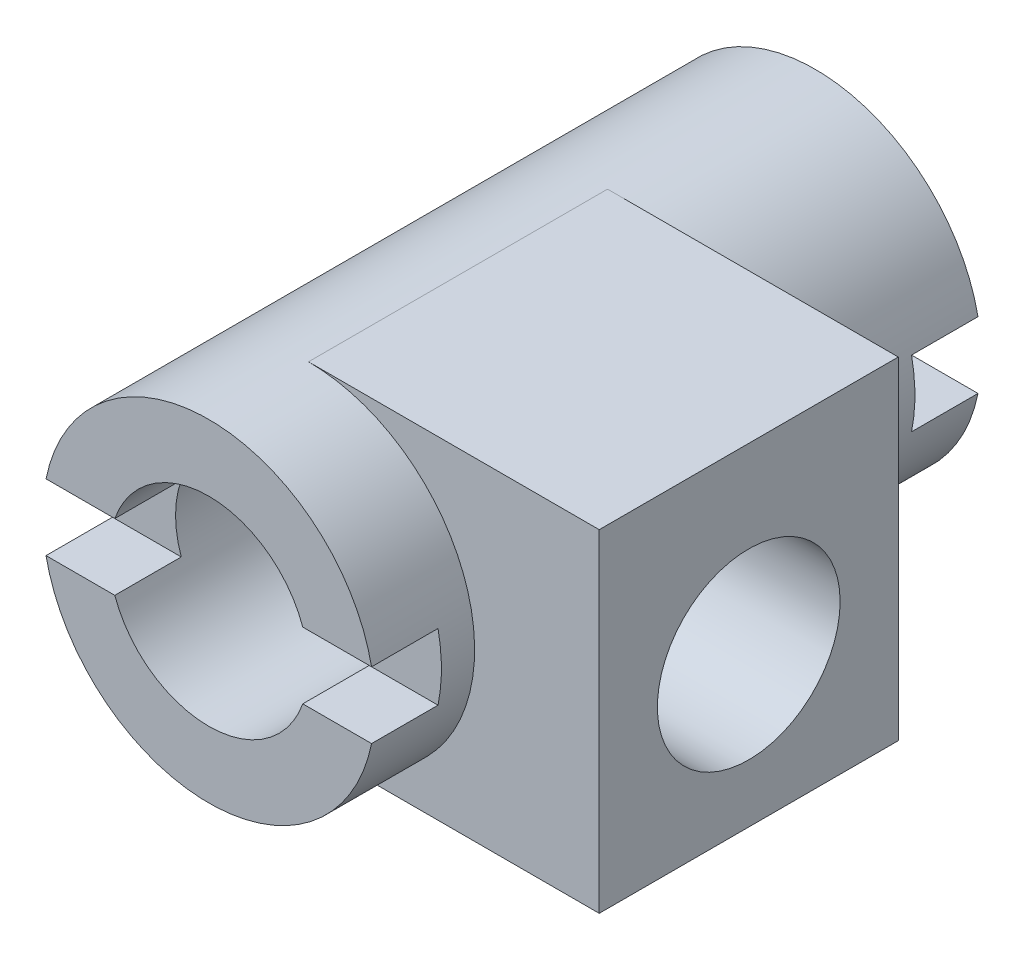
ISO-10303-21;
HEADER;
FILE_DESCRIPTION(('STEP AP214'),'2;1');
FILE_NAME('part.step','',(''),(''),'','','');
FILE_SCHEMA(('AUTOMOTIVE_DESIGN { 1 0 10303 214 1 1 1 1 }'));
ENDSEC;
DATA;
#1=APPLICATION_CONTEXT('core data for automotive mechanical design processes');
#2=APPLICATION_PROTOCOL_DEFINITION('international standard','automotive_design',2000,#1);
#3=PRODUCT_CONTEXT('',#1,'mechanical');
#4=PRODUCT('Part','Part','',(#3));
#5=PRODUCT_RELATED_PRODUCT_CATEGORY('part','',(#4));
#6=PRODUCT_DEFINITION_FORMATION('','',#4);
#7=PRODUCT_DEFINITION_CONTEXT('part definition',#1,'design');
#8=PRODUCT_DEFINITION('design','',#6,#7);
#9=PRODUCT_DEFINITION_SHAPE('','',#8);
#10=(LENGTH_UNIT() NAMED_UNIT(*) SI_UNIT(.MILLI.,.METRE.));
#11=(NAMED_UNIT(*) PLANE_ANGLE_UNIT() SI_UNIT($,.RADIAN.));
#12=(NAMED_UNIT(*) SI_UNIT($,.STERADIAN.) SOLID_ANGLE_UNIT());
#13=UNCERTAINTY_MEASURE_WITH_UNIT(LENGTH_MEASURE(1.E-05),#10,'distance_accuracy_value','');
#14=(GEOMETRIC_REPRESENTATION_CONTEXT(3) GLOBAL_UNCERTAINTY_ASSIGNED_CONTEXT((#13)) GLOBAL_UNIT_ASSIGNED_CONTEXT((#10,
#11,#12)) REPRESENTATION_CONTEXT('',''));
#15=CARTESIAN_POINT('',(0.,0.,0.));
#16=DIRECTION('',(0.,0.,1.));
#17=DIRECTION('',(1.,0.,0.));
#18=AXIS2_PLACEMENT_3D('',#15,#16,#17);
#19=CARTESIAN_POINT('',(0.,0.,-73.));
#20=DIRECTION('',(0.,0.,1.));
#21=DIRECTION('',(1.,0.,0.));
#22=AXIS2_PLACEMENT_3D('',#19,#20,#21);
#23=PLANE('',#22);
#24=CARTESIAN_POINT('',(0.,0.,-73.));
#25=DIRECTION('',(0.,0.,1.));
#26=DIRECTION('',(1.,0.,0.));
#27=AXIS2_PLACEMENT_3D('',#24,#25,#26);
#28=CIRCLE('',#27,20.);
#29=CARTESIAN_POINT('',(19.5959179422654,3.99999999999999,-73.));
#30=VERTEX_POINT('',#29);
#31=CARTESIAN_POINT('',(-19.5959179422654,4.,-73.));
#32=VERTEX_POINT('',#31);
#33=EDGE_CURVE('E195',#30,#32,#28,.T.);
#34=ORIENTED_EDGE('',*,*,#33,.F.);
#35=DIRECTION('',(1.,0.,0.));
#36=VECTOR('',#35,1.);
#37=CARTESIAN_POINT('',(21.2930166191036,3.99999999999999,-73.));
#38=LINE('',#37,#36);
#39=CARTESIAN_POINT('',(11.3137084989848,4.,-73.));
#40=VERTEX_POINT('',#39);
#41=EDGE_CURVE('E188',#40,#30,#38,.T.);
#42=ORIENTED_EDGE('',*,*,#41,.F.);
#43=CARTESIAN_POINT('',(0.,0.,-73.));
#44=DIRECTION('',(0.,0.,1.));
#45=DIRECTION('',(1.,0.,0.));
#46=AXIS2_PLACEMENT_3D('',#43,#44,#45);
#47=CIRCLE('',#46,12.);
#48=CARTESIAN_POINT('',(-11.3137084989848,4.,-73.));
#49=VERTEX_POINT('',#48);
#50=EDGE_CURVE('E343',#40,#49,#47,.T.);
#51=ORIENTED_EDGE('',*,*,#50,.T.);
#52=EDGE_CURVE('E242',#32,#49,#38,.T.);
#53=ORIENTED_EDGE('',*,*,#52,.F.);
#54=EDGE_LOOP('',(#34,#42,#51,#53));
#55=FACE_BOUND('',#54,.T.);
#56=ADVANCED_FACE('F33',(#55),#23,.F.);
#57=CARTESIAN_POINT('',(0.,0.,0.));
#58=DIRECTION('',(0.,0.,1.));
#59=DIRECTION('',(1.,0.,0.));
#60=AXIS2_PLACEMENT_3D('',#57,#58,#59);
#61=PLANE('',#60);
#62=DIRECTION('',(-1.,0.,0.));
#63=VECTOR('',#62,1.);
#64=CARTESIAN_POINT('',(-25.8708933431482,4.,0.));
#65=LINE('',#64,#63);
#66=CARTESIAN_POINT('',(19.5959179422654,4.,0.));
#67=VERTEX_POINT('',#66);
#68=CARTESIAN_POINT('',(11.3137084989848,4.,0.));
#69=VERTEX_POINT('',#68);
#70=EDGE_CURVE('E261',#67,#69,#65,.T.);
#71=ORIENTED_EDGE('',*,*,#70,.F.);
#72=CARTESIAN_POINT('',(0.,0.,0.));
#73=DIRECTION('',(0.,0.,1.));
#74=DIRECTION('',(1.,0.,0.));
#75=AXIS2_PLACEMENT_3D('',#72,#73,#74);
#76=CIRCLE('',#75,20.);
#77=CARTESIAN_POINT('',(-19.5959179422654,4.,0.));
#78=VERTEX_POINT('',#77);
#79=EDGE_CURVE('E196',#67,#78,#76,.T.);
#80=ORIENTED_EDGE('',*,*,#79,.T.);
#81=CARTESIAN_POINT('',(-11.3137084989848,4.,0.));
#82=VERTEX_POINT('',#81);
#83=EDGE_CURVE('E268',#82,#78,#65,.T.);
#84=ORIENTED_EDGE('',*,*,#83,.F.);
#85=CARTESIAN_POINT('',(0.,0.,0.));
#86=DIRECTION('',(0.,0.,1.));
#87=DIRECTION('',(1.,0.,0.));
#88=AXIS2_PLACEMENT_3D('',#85,#86,#87);
#89=CIRCLE('',#88,12.);
#90=EDGE_CURVE('E204',#69,#82,#89,.T.);
#91=ORIENTED_EDGE('',*,*,#90,.F.);
#92=EDGE_LOOP('',(#71,#80,#84,#91));
#93=FACE_BOUND('',#92,.T.);
#94=ADVANCED_FACE('F325',(#93),#61,.T.);
#95=CARTESIAN_POINT('',(0.,0.,-73.));
#96=DIRECTION('',(0.,0.,1.));
#97=DIRECTION('',(1.,0.,0.));
#98=AXIS2_PLACEMENT_3D('',#95,#96,#97);
#99=CYLINDRICAL_SURFACE('',#98,20.);
#100=DIRECTION('',(0.,0.,1.));
#101=VECTOR('',#100,1.);
#102=CARTESIAN_POINT('',(-19.5959179422654,4.,-73.));
#103=LINE('',#102,#101);
#104=CARTESIAN_POINT('',(-19.5959179422654,4.,-65.));
#105=VERTEX_POINT('',#104);
#106=EDGE_CURVE('E254',#105,#32,#103,.F.);
#107=ORIENTED_EDGE('',*,*,#106,.F.);
#108=CARTESIAN_POINT('',(0.,0.,-65.));
#109=DIRECTION('',(0.,0.,1.));
#110=DIRECTION('',(1.,0.,0.));
#111=AXIS2_PLACEMENT_3D('',#108,#109,#110);
#112=CIRCLE('',#111,20.);
#113=CARTESIAN_POINT('',(-19.5959179422654,-4.,-65.));
#114=VERTEX_POINT('',#113);
#115=EDGE_CURVE('E251',#114,#105,#112,.F.);
#116=ORIENTED_EDGE('',*,*,#115,.F.);
#117=DIRECTION('',(0.,0.,1.));
#118=VECTOR('',#117,1.);
#119=CARTESIAN_POINT('',(-19.5959179422654,-4.,-73.));
#120=LINE('',#119,#118);
#121=CARTESIAN_POINT('',(-19.5959179422654,-4.,-73.));
#122=VERTEX_POINT('',#121);
#123=EDGE_CURVE('E178',#122,#114,#120,.T.);
#124=ORIENTED_EDGE('',*,*,#123,.F.);
#125=CARTESIAN_POINT('',(19.5959179422654,-4.00000000000001,-73.));
#126=VERTEX_POINT('',#125);
#127=EDGE_CURVE('E185',#122,#126,#28,.T.);
#128=ORIENTED_EDGE('',*,*,#127,.T.);
#129=DIRECTION('',(0.,0.,1.));
#130=VECTOR('',#129,1.);
#131=CARTESIAN_POINT('',(19.5959179422654,-4.00000000000001,-73.));
#132=LINE('',#131,#130);
#133=CARTESIAN_POINT('',(19.5959179422654,-4.00000000000001,-65.));
#134=VERTEX_POINT('',#133);
#135=EDGE_CURVE('E169',#134,#126,#132,.F.);
#136=ORIENTED_EDGE('',*,*,#135,.F.);
#137=CARTESIAN_POINT('',(19.5959179422654,3.99999999999999,-65.));
#138=VERTEX_POINT('',#137);
#139=EDGE_CURVE('E249',#138,#134,#112,.F.);
#140=ORIENTED_EDGE('',*,*,#139,.F.);
#141=DIRECTION('',(0.,0.,1.));
#142=VECTOR('',#141,1.);
#143=CARTESIAN_POINT('',(19.5959179422654,3.99999999999999,-73.));
#144=LINE('',#143,#142);
#145=EDGE_CURVE('E177',#30,#138,#144,.T.);
#146=ORIENTED_EDGE('',*,*,#145,.F.);
#147=ORIENTED_EDGE('',*,*,#33,.T.);
#148=EDGE_LOOP('',(#107,#116,#124,#128,#136,#140,#146,#147));
#149=FACE_BOUND('',#148,.T.);
#150=DIRECTION('',(0.,0.,1.));
#151=VECTOR('',#150,1.);
#152=CARTESIAN_POINT('',(-19.5959179422654,4.,-73.));
#153=LINE('',#152,#151);
#154=CARTESIAN_POINT('',(-19.5959179422654,4.,-7.99999999999999));
#155=VERTEX_POINT('',#154);
#156=EDGE_CURVE('E280',#78,#155,#153,.F.);
#157=ORIENTED_EDGE('',*,*,#156,.F.);
#158=ORIENTED_EDGE('',*,*,#79,.F.);
#159=DIRECTION('',(0.,0.,1.));
#160=VECTOR('',#159,1.);
#161=CARTESIAN_POINT('',(19.5959179422654,4.,-73.));
#162=LINE('',#161,#160);
#163=CARTESIAN_POINT('',(19.5959179422654,4.,-7.99999999999999));
#164=VERTEX_POINT('',#163);
#165=EDGE_CURVE('E278',#164,#67,#162,.T.);
#166=ORIENTED_EDGE('',*,*,#165,.F.);
#167=CARTESIAN_POINT('',(0.,0.,-7.99999999999999));
#168=DIRECTION('',(0.,0.,1.));
#169=DIRECTION('',(1.,0.,0.));
#170=AXIS2_PLACEMENT_3D('',#167,#168,#169);
#171=CIRCLE('',#170,20.);
#172=CARTESIAN_POINT('',(19.5959179422654,-4.,-7.99999999999999));
#173=VERTEX_POINT('',#172);
#174=EDGE_CURVE('E270',#164,#173,#171,.F.);
#175=ORIENTED_EDGE('',*,*,#174,.T.);
#176=DIRECTION('',(0.,0.,1.));
#177=VECTOR('',#176,1.);
#178=CARTESIAN_POINT('',(19.5959179422654,-4.,-73.));
#179=LINE('',#178,#177);
#180=CARTESIAN_POINT('',(19.5959179422654,-4.,0.));
#181=VERTEX_POINT('',#180);
#182=EDGE_CURVE('E276',#181,#173,#179,.F.);
#183=ORIENTED_EDGE('',*,*,#182,.F.);
#184=CARTESIAN_POINT('',(-19.5959179422654,-4.,0.));
#185=VERTEX_POINT('',#184);
#186=EDGE_CURVE('E201',#185,#181,#76,.T.);
#187=ORIENTED_EDGE('',*,*,#186,.F.);
#188=DIRECTION('',(0.,0.,1.));
#189=VECTOR('',#188,1.);
#190=CARTESIAN_POINT('',(-19.5959179422654,-4.,-73.));
#191=LINE('',#190,#189);
#192=CARTESIAN_POINT('',(-19.5959179422654,-4.,-7.99999999999999));
#193=VERTEX_POINT('',#192);
#194=EDGE_CURVE('E274',#193,#185,#191,.T.);
#195=ORIENTED_EDGE('',*,*,#194,.F.);
#196=EDGE_CURVE('E273',#193,#155,#171,.F.);
#197=ORIENTED_EDGE('',*,*,#196,.T.);
#198=EDGE_LOOP('',(#157,#158,#166,#175,#183,#187,#195,#197));
#199=FACE_BOUND('',#198,.T.);
#200=CARTESIAN_POINT('',(0.,0.,-12.));
#201=DIRECTION('',(0.,0.,1.));
#202=DIRECTION('',(0.,-1.,0.));
#203=AXIS2_PLACEMENT_3D('',#200,#201,#202);
#204=CIRCLE('',#203,20.);
#205=CARTESIAN_POINT('',(0.,-20.,-12.));
#206=VERTEX_POINT('',#205);
#207=CARTESIAN_POINT('',(0.,20.,-12.));
#208=VERTEX_POINT('',#207);
#209=EDGE_CURVE('E355',#206,#208,#204,.T.);
#210=ORIENTED_EDGE('',*,*,#209,.T.);
#211=DIRECTION('',(0.,0.,1.));
#212=VECTOR('',#211,1.);
#213=CARTESIAN_POINT('',(0.,20.,-73.));
#214=LINE('',#213,#212);
#215=CARTESIAN_POINT('',(0.,20.,-48.));
#216=VERTEX_POINT('',#215);
#217=EDGE_CURVE('E282',#216,#208,#214,.T.);
#218=ORIENTED_EDGE('',*,*,#217,.F.);
#219=CARTESIAN_POINT('',(0.,0.,-48.));
#220=DIRECTION('',(0.,0.,-1.));
#221=DIRECTION('',(-1.,0.,0.));
#222=AXIS2_PLACEMENT_3D('',#219,#220,#221);
#223=CIRCLE('',#222,20.);
#224=CARTESIAN_POINT('',(0.,-20.,-48.));
#225=VERTEX_POINT('',#224);
#226=EDGE_CURVE('E356',#216,#225,#223,.T.);
#227=ORIENTED_EDGE('',*,*,#226,.T.);
#228=DIRECTION('',(0.,0.,1.));
#229=VECTOR('',#228,1.);
#230=CARTESIAN_POINT('',(0.,-20.,-73.));
#231=LINE('',#230,#229);
#232=EDGE_CURVE('E300',#225,#206,#231,.T.);
#233=ORIENTED_EDGE('',*,*,#232,.T.);
#234=EDGE_LOOP('',(#210,#218,#227,#233));
#235=FACE_BOUND('',#234,.T.);
#236=ADVANCED_FACE('F35',(#149,#199,#235),#99,.T.);
#237=ORIENTED_EDGE('',*,*,#127,.F.);
#238=DIRECTION('',(-1.,0.,0.));
#239=VECTOR('',#238,1.);
#240=CARTESIAN_POINT('',(21.2930166191036,-4.00000000000001,-73.));
#241=LINE('',#240,#239);
#242=CARTESIAN_POINT('',(-11.3137084989848,-4.,-73.));
#243=VERTEX_POINT('',#242);
#244=EDGE_CURVE('E189',#243,#122,#241,.T.);
#245=ORIENTED_EDGE('',*,*,#244,.F.);
#246=CARTESIAN_POINT('',(11.3137084989848,-4.,-73.));
#247=VERTEX_POINT('',#246);
#248=EDGE_CURVE('E187',#243,#247,#47,.T.);
#249=ORIENTED_EDGE('',*,*,#248,.T.);
#250=EDGE_CURVE('E172',#126,#247,#241,.T.);
#251=ORIENTED_EDGE('',*,*,#250,.F.);
#252=EDGE_LOOP('',(#237,#245,#249,#251));
#253=FACE_BOUND('',#252,.T.);
#254=ADVANCED_FACE('F183',(#253),#23,.F.);
#255=DIRECTION('',(1.,0.,0.));
#256=VECTOR('',#255,1.);
#257=CARTESIAN_POINT('',(-25.8708933431482,-4.,0.));
#258=LINE('',#257,#256);
#259=CARTESIAN_POINT('',(-11.3137084989848,-4.,0.));
#260=VERTEX_POINT('',#259);
#261=EDGE_CURVE('E267',#185,#260,#258,.T.);
#262=ORIENTED_EDGE('',*,*,#261,.F.);
#263=ORIENTED_EDGE('',*,*,#186,.T.);
#264=CARTESIAN_POINT('',(11.3137084989848,-4.,0.));
#265=VERTEX_POINT('',#264);
#266=EDGE_CURVE('E256',#265,#181,#258,.T.);
#267=ORIENTED_EDGE('',*,*,#266,.F.);
#268=EDGE_CURVE('E357',#260,#265,#89,.T.);
#269=ORIENTED_EDGE('',*,*,#268,.F.);
#270=EDGE_LOOP('',(#262,#263,#267,#269));
#271=FACE_BOUND('',#270,.T.);
#272=ADVANCED_FACE('F321',(#271),#61,.T.);
#273=CARTESIAN_POINT('',(0.,0.,-73.));
#274=DIRECTION('',(0.,0.,1.));
#275=DIRECTION('',(1.,0.,0.));
#276=AXIS2_PLACEMENT_3D('',#273,#274,#275);
#277=CYLINDRICAL_SURFACE('',#276,12.);
#278=CARTESIAN_POINT('',(0.,0.,-65.));
#279=DIRECTION('',(0.,0.,1.));
#280=DIRECTION('',(1.,0.,0.));
#281=AXIS2_PLACEMENT_3D('',#278,#279,#280);
#282=CIRCLE('',#281,12.);
#283=CARTESIAN_POINT('',(-11.3137084989848,-4.,-65.));
#284=VERTEX_POINT('',#283);
#285=CARTESIAN_POINT('',(-11.3137084989848,4.,-65.));
#286=VERTEX_POINT('',#285);
#287=EDGE_CURVE('E225',#284,#286,#282,.F.);
#288=ORIENTED_EDGE('',*,*,#287,.T.);
#289=DIRECTION('',(0.,0.,1.));
#290=VECTOR('',#289,1.);
#291=CARTESIAN_POINT('',(-11.3137084989848,4.,-73.));
#292=LINE('',#291,#290);
#293=EDGE_CURVE('E11',#286,#49,#292,.F.);
#294=ORIENTED_EDGE('',*,*,#293,.T.);
#295=ORIENTED_EDGE('',*,*,#50,.F.);
#296=DIRECTION('',(0.,0.,1.));
#297=VECTOR('',#296,1.);
#298=CARTESIAN_POINT('',(11.3137084989848,4.,-73.));
#299=LINE('',#298,#297);
#300=CARTESIAN_POINT('',(11.3137084989848,4.,-65.));
#301=VERTEX_POINT('',#300);
#302=EDGE_CURVE('E227',#40,#301,#299,.T.);
#303=ORIENTED_EDGE('',*,*,#302,.T.);
#304=CARTESIAN_POINT('',(11.3137084989848,-4.,-65.));
#305=VERTEX_POINT('',#304);
#306=EDGE_CURVE('E221',#301,#305,#282,.F.);
#307=ORIENTED_EDGE('',*,*,#306,.T.);
#308=DIRECTION('',(0.,0.,1.));
#309=VECTOR('',#308,1.);
#310=CARTESIAN_POINT('',(11.3137084989848,-4.,-73.));
#311=LINE('',#310,#309);
#312=EDGE_CURVE('E224',#305,#247,#311,.F.);
#313=ORIENTED_EDGE('',*,*,#312,.T.);
#314=ORIENTED_EDGE('',*,*,#248,.F.);
#315=DIRECTION('',(0.,0.,1.));
#316=VECTOR('',#315,1.);
#317=CARTESIAN_POINT('',(-11.3137084989848,-4.,-73.));
#318=LINE('',#317,#316);
#319=EDGE_CURVE('E41',#243,#284,#318,.T.);
#320=ORIENTED_EDGE('',*,*,#319,.T.);
#321=EDGE_LOOP('',(#288,#294,#295,#303,#307,#313,#314,#320));
#322=FACE_BOUND('',#321,.T.);
#323=ORIENTED_EDGE('',*,*,#90,.T.);
#324=DIRECTION('',(0.,0.,1.));
#325=VECTOR('',#324,1.);
#326=CARTESIAN_POINT('',(-11.3137084989848,4.,-73.));
#327=LINE('',#326,#325);
#328=CARTESIAN_POINT('',(-11.3137084989848,4.,-7.99999999999999));
#329=VERTEX_POINT('',#328);
#330=EDGE_CURVE('E218',#82,#329,#327,.F.);
#331=ORIENTED_EDGE('',*,*,#330,.T.);
#332=CARTESIAN_POINT('',(0.,0.,-7.99999999999999));
#333=DIRECTION('',(0.,0.,1.));
#334=DIRECTION('',(1.,0.,0.));
#335=AXIS2_PLACEMENT_3D('',#332,#333,#334);
#336=CIRCLE('',#335,12.);
#337=CARTESIAN_POINT('',(-11.3137084989848,-4.,-7.99999999999999));
#338=VERTEX_POINT('',#337);
#339=EDGE_CURVE('E209',#338,#329,#336,.F.);
#340=ORIENTED_EDGE('',*,*,#339,.F.);
#341=DIRECTION('',(0.,0.,1.));
#342=VECTOR('',#341,1.);
#343=CARTESIAN_POINT('',(-11.3137084989848,-4.,-73.));
#344=LINE('',#343,#342);
#345=EDGE_CURVE('E215',#338,#260,#344,.T.);
#346=ORIENTED_EDGE('',*,*,#345,.T.);
#347=ORIENTED_EDGE('',*,*,#268,.T.);
#348=DIRECTION('',(0.,0.,1.));
#349=VECTOR('',#348,1.);
#350=CARTESIAN_POINT('',(11.3137084989848,-4.,-73.));
#351=LINE('',#350,#349);
#352=CARTESIAN_POINT('',(11.3137084989848,-4.,-7.99999999999999));
#353=VERTEX_POINT('',#352);
#354=EDGE_CURVE('E208',#265,#353,#351,.F.);
#355=ORIENTED_EDGE('',*,*,#354,.T.);
#356=CARTESIAN_POINT('',(11.3137084989848,4.,-7.99999999999999));
#357=VERTEX_POINT('',#356);
#358=EDGE_CURVE('E199',#357,#353,#336,.F.);
#359=ORIENTED_EDGE('',*,*,#358,.F.);
#360=DIRECTION('',(0.,0.,1.));
#361=VECTOR('',#360,1.);
#362=CARTESIAN_POINT('',(11.3137084989848,4.,-73.));
#363=LINE('',#362,#361);
#364=EDGE_CURVE('E212',#357,#69,#363,.T.);
#365=ORIENTED_EDGE('',*,*,#364,.T.);
#366=EDGE_LOOP('',(#323,#331,#340,#346,#347,#355,#359,#365));
#367=FACE_BOUND('',#366,.T.);
#368=ADVANCED_FACE('F232',(#322,#367),#277,.F.);
#369=CARTESIAN_POINT('',(-20.001,20.,-12.));
#370=DIRECTION('',(0.,1.,0.));
#371=DIRECTION('',(0.,0.,1.));
#372=AXIS2_PLACEMENT_3D('',#369,#370,#371);
#373=PLANE('',#372);
#374=DIRECTION('',(1.,0.,0.));
#375=VECTOR('',#374,1.);
#376=CARTESIAN_POINT('',(-20.001,20.,-48.));
#377=LINE('',#376,#375);
#378=CARTESIAN_POINT('',(35.,20.,-48.));
#379=VERTEX_POINT('',#378);
#380=EDGE_CURVE('E296',#216,#379,#377,.T.);
#381=ORIENTED_EDGE('',*,*,#380,.F.);
#382=ORIENTED_EDGE('',*,*,#217,.T.);
#383=DIRECTION('',(1.,0.,0.));
#384=VECTOR('',#383,1.);
#385=CARTESIAN_POINT('',(-20.001,20.,-12.));
#386=LINE('',#385,#384);
#387=CARTESIAN_POINT('',(35.,20.,-12.));
#388=VERTEX_POINT('',#387);
#389=EDGE_CURVE('E348',#208,#388,#386,.T.);
#390=ORIENTED_EDGE('',*,*,#389,.T.);
#391=DIRECTION('',(0.,0.,1.));
#392=VECTOR('',#391,1.);
#393=CARTESIAN_POINT('',(35.,20.,-12.));
#394=LINE('',#393,#392);
#395=EDGE_CURVE('E290',#379,#388,#394,.T.);
#396=ORIENTED_EDGE('',*,*,#395,.F.);
#397=EDGE_LOOP('',(#381,#382,#390,#396));
#398=FACE_BOUND('',#397,.T.);
#399=ADVANCED_FACE('F320',(#398),#373,.T.);
#400=CARTESIAN_POINT('',(-20.001,-20.,-12.));
#401=DIRECTION('',(0.,0.,1.));
#402=DIRECTION('',(0.,-1.,0.));
#403=AXIS2_PLACEMENT_3D('',#400,#401,#402);
#404=PLANE('',#403);
#405=ORIENTED_EDGE('',*,*,#209,.F.);
#406=DIRECTION('',(1.,0.,0.));
#407=VECTOR('',#406,1.);
#408=CARTESIAN_POINT('',(-20.001,-20.,-12.));
#409=LINE('',#408,#407);
#410=CARTESIAN_POINT('',(35.,-20.,-12.));
#411=VERTEX_POINT('',#410);
#412=EDGE_CURVE('E350',#206,#411,#409,.T.);
#413=ORIENTED_EDGE('',*,*,#412,.T.);
#414=DIRECTION('',(0.,-1.,0.));
#415=VECTOR('',#414,1.);
#416=CARTESIAN_POINT('',(35.,-20.,-12.));
#417=LINE('',#416,#415);
#418=EDGE_CURVE('E287',#388,#411,#417,.T.);
#419=ORIENTED_EDGE('',*,*,#418,.F.);
#420=ORIENTED_EDGE('',*,*,#389,.F.);
#421=EDGE_LOOP('',(#405,#413,#419,#420));
#422=FACE_BOUND('',#421,.T.);
#423=ADVANCED_FACE('F407',(#422),#404,.T.);
#424=CARTESIAN_POINT('',(-20.001,-20.,-12.));
#425=DIRECTION('',(0.,-1.,0.));
#426=DIRECTION('',(0.,0.,-1.));
#427=AXIS2_PLACEMENT_3D('',#424,#425,#426);
#428=PLANE('',#427);
#429=ORIENTED_EDGE('',*,*,#232,.F.);
#430=DIRECTION('',(1.,0.,0.));
#431=VECTOR('',#430,1.);
#432=CARTESIAN_POINT('',(-20.001,-20.,-48.));
#433=LINE('',#432,#431);
#434=CARTESIAN_POINT('',(35.,-20.,-48.));
#435=VERTEX_POINT('',#434);
#436=EDGE_CURVE('E352',#225,#435,#433,.T.);
#437=ORIENTED_EDGE('',*,*,#436,.T.);
#438=DIRECTION('',(0.,0.,-1.));
#439=VECTOR('',#438,1.);
#440=CARTESIAN_POINT('',(35.,-20.,-12.));
#441=LINE('',#440,#439);
#442=EDGE_CURVE('E283',#411,#435,#441,.T.);
#443=ORIENTED_EDGE('',*,*,#442,.F.);
#444=ORIENTED_EDGE('',*,*,#412,.F.);
#445=EDGE_LOOP('',(#429,#437,#443,#444));
#446=FACE_BOUND('',#445,.T.);
#447=ADVANCED_FACE('F405',(#446),#428,.T.);
#448=CARTESIAN_POINT('',(-20.001,-20.,-48.));
#449=DIRECTION('',(0.,0.,-1.));
#450=DIRECTION('',(-1.,0.,0.));
#451=AXIS2_PLACEMENT_3D('',#448,#449,#450);
#452=PLANE('',#451);
#453=ORIENTED_EDGE('',*,*,#226,.F.);
#454=ORIENTED_EDGE('',*,*,#380,.T.);
#455=DIRECTION('',(0.,1.,0.));
#456=VECTOR('',#455,1.);
#457=CARTESIAN_POINT('',(35.,-20.,-48.));
#458=LINE('',#457,#456);
#459=EDGE_CURVE('E293',#435,#379,#458,.T.);
#460=ORIENTED_EDGE('',*,*,#459,.F.);
#461=ORIENTED_EDGE('',*,*,#436,.F.);
#462=EDGE_LOOP('',(#453,#454,#460,#461));
#463=FACE_BOUND('',#462,.T.);
#464=ADVANCED_FACE('F316',(#463),#452,.T.);
#465=CARTESIAN_POINT('',(35.,0.,0.));
#466=DIRECTION('',(-1.,0.,0.));
#467=DIRECTION('',(0.,0.,1.));
#468=AXIS2_PLACEMENT_3D('',#465,#466,#467);
#469=PLANE('',#468);
#470=CARTESIAN_POINT('',(35.,-2.,-30.));
#471=DIRECTION('',(1.,0.,0.));
#472=DIRECTION('',(0.,0.,-1.));
#473=AXIS2_PLACEMENT_3D('',#470,#471,#472);
#474=CIRCLE('',#473,11.);
#475=CARTESIAN_POINT('',(35.,-2.,-41.));
#476=VERTEX_POINT('',#475);
#477=EDGE_CURVE('E297',#476,#476,#474,.T.);
#478=ORIENTED_EDGE('',*,*,#477,.F.);
#479=EDGE_LOOP('',(#478));
#480=FACE_BOUND('',#479,.T.);
#481=ORIENTED_EDGE('',*,*,#459,.T.);
#482=ORIENTED_EDGE('',*,*,#395,.T.);
#483=ORIENTED_EDGE('',*,*,#418,.T.);
#484=ORIENTED_EDGE('',*,*,#442,.T.);
#485=EDGE_LOOP('',(#481,#482,#483,#484));
#486=FACE_BOUND('',#485,.T.);
#487=ADVANCED_FACE('F409',(#480,#486),#469,.F.);
#488=CARTESIAN_POINT('',(-20.001,-2.,-30.));
#489=DIRECTION('',(1.,0.,0.));
#490=DIRECTION('',(0.,0.,-1.));
#491=AXIS2_PLACEMENT_3D('',#488,#489,#490);
#492=CYLINDRICAL_SURFACE('',#491,11.);
#493=CARTESIAN_POINT('',(19.8997487421324,-2.,-41.));
#494=CARTESIAN_POINT('',(19.870172167618,-2.2942657538272,-40.999998107226));
#495=CARTESIAN_POINT('',(19.8340524568988,-2.58790615249877,-40.9881761925562));
#496=CARTESIAN_POINT('',(19.7491413385936,-3.17150084512354,-40.9413583905035));
#497=CARTESIAN_POINT('',(19.7003477525085,-3.46145449636894,-40.9063585174813));
#498=CARTESIAN_POINT('',(19.5907784234332,-4.03570522512141,-40.8139056140748));
#499=CARTESIAN_POINT('',(19.5299924964218,-4.31999726724742,-40.7564334589771));
#500=CARTESIAN_POINT('',(19.3974604911057,-4.88073117690603,-40.6200120745925));
#501=CARTESIAN_POINT('',(19.3257147204311,-5.15717326451952,-40.5410634480765));
#502=CARTESIAN_POINT('',(19.172852804483,-5.69917513465971,-40.3632540186788));
#503=CARTESIAN_POINT('',(19.0917873982571,-5.96478408801581,-40.2644990436833));
#504=CARTESIAN_POINT('',(18.9213011023523,-6.48532043543636,-40.0479536280864));
#505=CARTESIAN_POINT('',(18.8318802153776,-6.7402478329578,-39.9301631936458));
#506=CARTESIAN_POINT('',(18.6461063758638,-7.23832580919479,-39.6766740849201));
#507=CARTESIAN_POINT('',(18.5497545038386,-7.48147821373982,-39.5409781992859));
#508=CARTESIAN_POINT('',(18.3515762857321,-7.95522434744594,-39.2526865452685));
#509=CARTESIAN_POINT('',(18.2497492871867,-8.18581657320517,-39.1000887603994));
#510=CARTESIAN_POINT('',(18.0322277310146,-8.65516616232001,-38.763557514949));
#511=CARTESIAN_POINT('',(17.916138571679,-8.89259342293488,-38.5780228174111));
#512=CARTESIAN_POINT('',(17.681351209366,-9.35072648574116,-38.1888444505392));
#513=CARTESIAN_POINT('',(17.5626528596357,-9.57143134426686,-37.9851997606434));
#514=CARTESIAN_POINT('',(17.3246797225058,-9.99573568237204,-37.5603240650895));
#515=CARTESIAN_POINT('',(17.2054043023439,-10.1993058660204,-37.3390641498261));
#516=CARTESIAN_POINT('',(16.9688867313893,-10.5881382371438,-36.8799977209076));
#517=CARTESIAN_POINT('',(16.8516445443678,-10.7734007511076,-36.6421915024589));
#518=CARTESIAN_POINT('',(16.6098177434426,-11.1430546251067,-36.1250171998043));
#519=CARTESIAN_POINT('',(16.4857413033535,-11.3253430475875,-35.8439005151385));
#520=CARTESIAN_POINT('',(16.2471341498201,-11.6650650524327,-35.2630522710322));
#521=CARTESIAN_POINT('',(16.1326054003695,-11.8224935269441,-34.9633169036831));
#522=CARTESIAN_POINT('',(15.9177299242865,-12.1102456772819,-34.3472098618863));
#523=CARTESIAN_POINT('',(15.8173478453087,-12.240637316899,-34.0308824694394));
#524=CARTESIAN_POINT('',(15.6350952903486,-12.4725943772066,-33.3827558402632));
#525=CARTESIAN_POINT('',(15.5532134867879,-12.5741774469435,-33.0509662218947));
#526=CARTESIAN_POINT('',(15.4349463925445,-12.718810256996,-32.4826592514272));
#527=CARTESIAN_POINT('',(15.3923802190528,-12.7701948130916,-32.2495155433988));
#528=CARTESIAN_POINT('',(15.3191951095282,-12.8578979926929,-31.7785859458168));
#529=CARTESIAN_POINT('',(15.2885729994911,-12.894220618904,-31.5408013072006));
#530=CARTESIAN_POINT('',(15.2403046324329,-12.9512360519242,-31.0622781942519));
#531=CARTESIAN_POINT('',(15.2226462719842,-12.9719434381808,-30.821542689048));
#532=CARTESIAN_POINT('',(15.2008779214365,-12.9974457668241,-30.338602973654));
#533=CARTESIAN_POINT('',(15.1967683629174,-13.0022402023241,-30.096398716925));
#534=CARTESIAN_POINT('',(15.2022511828026,-12.9958291617056,-29.6121492247549));
#535=CARTESIAN_POINT('',(15.2118554628106,-12.984609787949,-29.3701043100478));
#536=CARTESIAN_POINT('',(15.2444405411288,-12.9463376251064,-28.8881880319532));
#537=CARTESIAN_POINT('',(15.2674214038229,-12.9192847598109,-28.648316679033));
#538=CARTESIAN_POINT('',(15.3259834001829,-12.8497583440205,-28.172255326832));
#539=CARTESIAN_POINT('',(15.3615716998594,-12.8072760231451,-27.9360675011278));
#540=CARTESIAN_POINT('',(15.444223825166,-12.707483667788,-27.4688138427148));
#541=CARTESIAN_POINT('',(15.4912923882436,-12.6501675113752,-27.237750167592));
#542=CARTESIAN_POINT('',(15.5961366638702,-12.5206837940701,-26.7793523678424));
#543=CARTESIAN_POINT('',(15.6540277869691,-12.4483551266001,-26.5520902913049));
#544=CARTESIAN_POINT('',(15.7786566785669,-12.2900026868938,-26.1048507245127));
#545=CARTESIAN_POINT('',(15.845397952267,-12.2039734856801,-25.8848761639296));
#546=CARTESIAN_POINT('',(16.0566086551086,-11.9264080947581,-25.2369069550314));
#547=CARTESIAN_POINT('',(16.2121211163045,-11.7153271002316,-24.8206331449451));
#548=CARTESIAN_POINT('',(16.4761547347036,-11.3387213678572,-24.1804544115069));
#549=CARTESIAN_POINT('',(16.5791144086246,-11.1879107790369,-23.9452600868856));
#550=CARTESIAN_POINT('',(16.789346665933,-10.8698725531304,-23.4882582595165));
#551=CARTESIAN_POINT('',(16.8966186306626,-10.7026472660323,-23.2664488478564));
#552=CARTESIAN_POINT('',(17.1134880350792,-10.3523437018297,-22.8365268942937));
#553=CARTESIAN_POINT('',(17.2230877834484,-10.1692490726554,-22.6284288788977));
#554=CARTESIAN_POINT('',(17.4425917104795,-9.7879718066763,-22.2267006426935));
#555=CARTESIAN_POINT('',(17.5524959080146,-9.58978821336067,-22.0330713406218));
#556=CARTESIAN_POINT('',(17.790461177453,-9.14192627280347,-21.6274343433903));
#557=CARTESIAN_POINT('',(17.918231265238,-8.88939846617795,-21.4183881117566));
#558=CARTESIAN_POINT('',(18.1689172766235,-8.36509979141093,-21.0226177274115));
#559=CARTESIAN_POINT('',(18.2918325983124,-8.09332654874416,-20.8358963368336));
#560=CARTESIAN_POINT('',(18.5301523306397,-7.53169907982872,-20.4863420430817));
#561=CARTESIAN_POINT('',(18.6455570836886,-7.2418456790449,-20.3235080504445));
#562=CARTESIAN_POINT('',(18.866328810386,-6.64550168018681,-20.0234931401166));
#563=CARTESIAN_POINT('',(18.9716967451802,-6.33901267959204,-19.886309764858));
#564=CARTESIAN_POINT('',(19.1663537514479,-5.72287993124724,-19.6440531028484));
#565=CARTESIAN_POINT('',(19.256093789908,-5.41377342223869,-19.5379787572134));
#566=CARTESIAN_POINT('',(19.4221425501822,-4.78397307492428,-19.353067257395));
#567=CARTESIAN_POINT('',(19.4984513076134,-4.46327926734831,-19.2742300309836));
#568=CARTESIAN_POINT('',(19.6359021929973,-3.81333696488621,-19.1454420344422));
#569=CARTESIAN_POINT('',(19.6970618032972,-3.48409881983783,-19.0954578779269));
#570=CARTESIAN_POINT('',(19.803064942538,-2.81986716099792,-19.0255169888679));
#571=CARTESIAN_POINT('',(19.8479113618341,-2.48487467777992,-19.005554935071));
#572=CARTESIAN_POINT('',(19.9153094507648,-1.86123028669875,-18.9971144852295));
#573=CARTESIAN_POINT('',(19.9401455599339,-1.57287285509214,-19.004505571512));
#574=CARTESIAN_POINT('',(19.9772259467676,-0.996845418090681,-19.0420369744124));
#575=CARTESIAN_POINT('',(19.9894716341997,-0.709175339331442,-19.0721747433962));
#576=CARTESIAN_POINT('',(20.0015791813819,-0.136906638676051,-19.1550716156415));
#577=CARTESIAN_POINT('',(20.0014430374921,0.147692470961226,-19.2078270708198));
#578=CARTESIAN_POINT('',(19.9893260221856,0.711603762033967,-19.3355366569216));
#579=CARTESIAN_POINT('',(19.9773451528702,0.9909159444073,-19.410490783907));
#580=CARTESIAN_POINT('',(19.9433560631337,1.52659339145337,-19.577076364164));
#581=CARTESIAN_POINT('',(19.9219507799872,1.78336491892817,-19.6675303713649));
#582=CARTESIAN_POINT('',(19.8702268465846,2.28880891644586,-19.8668885330386));
#583=CARTESIAN_POINT('',(19.8399051628486,2.53747859809679,-19.9757989612832));
#584=CARTESIAN_POINT('',(19.7714213118158,3.02514802477289,-20.2111706779683));
#585=CARTESIAN_POINT('',(19.7332612421543,3.26415033644985,-20.3376272679378));
#586=CARTESIAN_POINT('',(19.6502622739043,3.73142508500438,-20.6072600016581));
#587=CARTESIAN_POINT('',(19.6054207792503,3.95969330559631,-20.7504426396176));
#588=CARTESIAN_POINT('',(19.5071312877383,4.41935829192971,-21.0627651751175));
#589=CARTESIAN_POINT('',(19.4533068047766,4.64992774401563,-21.2330044385492));
#590=CARTESIAN_POINT('',(19.3411088180106,5.09652373886272,-21.5904105791487));
#591=CARTESIAN_POINT('',(19.2827332935705,5.31254374149855,-21.7775849814092));
#592=CARTESIAN_POINT('',(19.1631160375495,5.72904442442704,-22.1678011814612));
#593=CARTESIAN_POINT('',(19.1018732107274,5.92951908781045,-22.3708490627091));
#594=CARTESIAN_POINT('',(18.9782716931045,6.3139511762012,-22.7917093187705));
#595=CARTESIAN_POINT('',(18.9159129519453,6.4979078535269,-23.0095223611423));
#596=CARTESIAN_POINT('',(18.7860073097413,6.86493294241432,-23.4800196433164));
#597=CARTESIAN_POINT('',(18.7185236277241,7.04629293570073,-23.7340572686737));
#598=CARTESIAN_POINT('',(18.5866890094635,7.3870403623536,-24.2571033397031));
#599=CARTESIAN_POINT('',(18.5223369733008,7.54643554691811,-24.5261064568945));
#600=CARTESIAN_POINT('',(18.3990436919891,7.84225022477764,-25.0777950416704));
#601=CARTESIAN_POINT('',(18.3401043596616,7.97866160982335,-25.360485292729));
#602=CARTESIAN_POINT('',(18.2299588214223,8.22721630327872,-25.9376472182391));
#603=CARTESIAN_POINT('',(18.1787488260566,8.33937151548895,-26.2321130293367));
#604=CARTESIAN_POINT('',(18.0867018704455,8.53715321973392,-26.82737331299));
#605=CARTESIAN_POINT('',(18.0457467829773,8.623084578453,-27.1280479322102));
#606=CARTESIAN_POINT('',(17.9751807440046,8.76923499383788,-27.7369093885757));
#607=CARTESIAN_POINT('',(17.9455697085286,8.82945424083171,-28.045096170096));
#608=CARTESIAN_POINT('',(17.8990680410552,8.9233467940054,-28.6661886990092));
#609=CARTESIAN_POINT('',(17.882166983734,8.95704185763517,-28.9790903636453));
#610=CARTESIAN_POINT('',(17.8618556807591,8.99747968450641,-29.6070553792485));
#611=CARTESIAN_POINT('',(17.8584441377467,9.00422503964625,-29.9221185194152));
#612=CARTESIAN_POINT('',(17.8649242892832,8.99135654146833,-30.5199012147916));
#613=CARTESIAN_POINT('',(17.8735157042135,8.97431922328284,-30.8026945701404));
#614=CARTESIAN_POINT('',(17.9013992368431,8.91856933518526,-31.3655836795244));
#615=CARTESIAN_POINT('',(17.9206905776481,8.87985833894169,-31.6456796279095));
#616=CARTESIAN_POINT('',(17.9692437533174,8.78118958337353,-32.2012675921184));
#617=CARTESIAN_POINT('',(17.9985075337019,8.721227678124,-32.4767586985749));
#618=CARTESIAN_POINT('',(18.0659345698469,8.58068018675224,-33.0213065354308));
#619=CARTESIAN_POINT('',(18.1040981484579,8.50009385244448,-33.2903630320167));
#620=CARTESIAN_POINT('',(18.188016913152,8.31901386324003,-33.8205267802522));
#621=CARTESIAN_POINT('',(18.2337735315297,8.21851645177078,-34.0816325211118));
#622=CARTESIAN_POINT('',(18.3313894895947,7.99841461525248,-34.5945243627331));
#623=CARTESIAN_POINT('',(18.3832509619769,7.87880350769814,-34.8463071659607));
#624=CARTESIAN_POINT('',(18.5456206049086,7.49253494528758,-35.5857754903577));
#625=CARTESIAN_POINT('',(18.6629608903922,7.19834638234218,-36.0578594150752));
#626=CARTESIAN_POINT('',(18.9148742193239,6.50958777820577,-36.9971097491314));
#627=CARTESIAN_POINT('',(19.0499867727941,6.10785522958527,-37.4589021118361));
#628=CARTESIAN_POINT('',(19.2441702714085,5.45108401887138,-38.0978355194327));
#629=CARTESIAN_POINT('',(19.307520577293,5.22297305005099,-38.3019641508817));
#630=CARTESIAN_POINT('',(19.4293707121216,4.74965214166891,-38.6911446063044));
#631=CARTESIAN_POINT('',(19.487869991314,4.50444026989626,-38.8761942686944));
#632=CARTESIAN_POINT('',(19.599529980242,3.99115963771856,-39.2307121459187));
#633=CARTESIAN_POINT('',(19.6524926650795,3.72264031975332,-39.3995909245474));
#634=CARTESIAN_POINT('',(19.749030883497,3.17083065640251,-39.7140767019858));
#635=CARTESIAN_POINT('',(19.7926107038818,2.88754713022078,-39.8596943203785));
#636=CARTESIAN_POINT('',(19.8684736956157,2.30844982418568,-40.1261416670605));
#637=CARTESIAN_POINT('',(19.9007687102724,2.01264954841285,-40.24699732736));
#638=CARTESIAN_POINT('',(19.9524723613412,1.41067867657305,-40.4627636104472));
#639=CARTESIAN_POINT('',(19.971884640729,1.10451103794646,-40.5576815634213));
#640=CARTESIAN_POINT('',(19.9932718401736,0.566705446395197,-40.6989520257732));
#641=CARTESIAN_POINT('',(19.9985032045855,0.336802687054614,-40.7515090607237));
#642=CARTESIAN_POINT('',(20.0009413656778,-0.126008801258687,-40.8417587523209));
#643=CARTESIAN_POINT('',(19.9981466291344,-0.358918096108333,-40.8794485673226));
#644=CARTESIAN_POINT('',(19.9842870132331,-0.826408877765319,-40.939754345625));
#645=CARTESIAN_POINT('',(19.9732230869436,-1.0609901687803,-40.9623720454998));
#646=CARTESIAN_POINT('',(19.9427399969578,-1.53051346415349,-40.9924938839757));
#647=CARTESIAN_POINT('',(19.9233227617162,-1.7654553727926,-41.0000015086362));
#648=CARTESIAN_POINT('',(19.8997487421324,-2.,-41.));
#649=B_SPLINE_CURVE_WITH_KNOTS('',3,(#493,#494,#495,#496,#497,#498,#499,#500,#501,#502,#503,
#504,#505,#506,#507,#508,#509,#510,#511,#512,#513,#514,#515,#516,#517,#518,#519,#520,#521,#522,
#523,#524,#525,#526,#527,#528,#529,#530,#531,#532,#533,#534,#535,#536,#537,#538,#539,#540,#541,
#542,#543,#544,#545,#546,#547,#548,#549,#550,#551,#552,#553,#554,#555,#556,#557,#558,#559,#560,
#561,#562,#563,#564,#565,#566,#567,#568,#569,#570,#571,#572,#573,#574,#575,#576,#577,#578,#579,
#580,#581,#582,#583,#584,#585,#586,#587,#588,#589,#590,#591,#592,#593,#594,#595,#596,#597,#598,
#599,#600,#601,#602,#603,#604,#605,#606,#607,#608,#609,#610,#611,#612,#613,#614,#615,#616,#617,
#618,#619,#620,#621,#622,#623,#624,#625,#626,#627,#628,#629,#630,#631,#632,#633,#634,#635,#636,
#637,#638,#639,#640,#641,#642,#643,#644,#645,#646,#647,#648),.UNSPECIFIED.,.T.,.F.,(4,2,2,2,2,2,
2,2,2,2,2,2,2,2,2,2,2,2,2,2,2,2,2,2,2,2,2,2,2,2,2,2,2,2,2,2,2,2,2,2,2,2,2,2,2,2,2,2,2,2,2,2,2,2,
2,2,2,2,2,2,2,2,2,2,2,2,2,2,2,2,2,2,2,2,2,2,2,4),(0.,0.887001314319548,1.7741551953802,
2.66206572506566,3.5499513367143,4.43321352836123,5.3164754341449,6.1995999399698,
7.08282992092824,8.05057592076433,9.01837649108617,9.98779949439183,10.9572052064312,
12.0276389438019,13.098292332633,14.1662208375095,15.23349367507,15.960285816483,
16.6868846890363,17.4128043167542,18.1387470674993,18.8653202132927,19.5918968562448,
20.318887146477,21.046177945726,21.7817195639241,22.5175533766234,23.9884790473773,
24.8811292050339,25.7736517535047,26.6671051636771,27.560615258366,28.6148872553286,
29.6692895570515,30.7236437543336,31.777896882848,32.7931047251078,33.8083098752015,
34.8223379468774,35.8361862664403,36.7036146472067,37.5709458901943,38.438137290992,
39.3053285379538,40.1236647689394,40.9422797317086,41.7606759091688,42.5793909074431,
43.4533231178075,44.3276455833137,45.2023047882577,46.0770035644486,47.0339112043525,
47.9904802899841,48.9473861316969,49.9038212975737,50.8486719577978,51.7935156238594,
52.7375834366999,53.681560451277,54.5308352272359,55.3800483475926,56.2294272356225,
57.0788369406552,57.928407054536,58.7782748464855,60.4771253215525,62.3486011130033,
63.2855032283847,64.2225113752852,65.1860468069323,66.1491410838743,67.1112215441843,
68.073029831644,68.7801241349855,69.4873535233389,70.1945014122735,70.9014861357549),.UNSPECIFIED.);
#650=CARTESIAN_POINT('',(19.8997487421324,-2.,-41.));
#651=VERTEX_POINT('',#650);
#652=EDGE_CURVE('E286',#651,#651,#649,.T.);
#653=ORIENTED_EDGE('',*,*,#652,.T.);
#654=EDGE_LOOP('',(#653));
#655=FACE_BOUND('',#654,.T.);
#656=ORIENTED_EDGE('',*,*,#477,.T.);
#657=EDGE_LOOP('',(#656));
#658=FACE_BOUND('',#657,.T.);
#659=ADVANCED_FACE('F309',(#655,#658),#492,.F.);
#660=ORIENTED_EDGE('',*,*,#652,.F.);
#661=EDGE_LOOP('',(#660));
#662=FACE_BOUND('',#661,.T.);
#663=ADVANCED_FACE('F416',(#662),#99,.T.);
#664=CARTESIAN_POINT('',(0.,0.,-8.));
#665=DIRECTION('',(0.,0.,1.));
#666=DIRECTION('',(1.,0.,0.));
#667=AXIS2_PLACEMENT_3D('',#664,#665,#666);
#668=PLANE('',#667);
#669=DIRECTION('',(-1.,0.,0.));
#670=VECTOR('',#669,1.);
#671=CARTESIAN_POINT('',(-25.8708933431482,4.,-8.));
#672=LINE('',#671,#670);
#673=EDGE_CURVE('E265',#164,#357,#672,.T.);
#674=ORIENTED_EDGE('',*,*,#673,.T.);
#675=ORIENTED_EDGE('',*,*,#358,.T.);
#676=DIRECTION('',(1.,0.,0.));
#677=VECTOR('',#676,1.);
#678=CARTESIAN_POINT('',(-25.8708933431482,-4.,-8.));
#679=LINE('',#678,#677);
#680=EDGE_CURVE('E257',#353,#173,#679,.T.);
#681=ORIENTED_EDGE('',*,*,#680,.T.);
#682=ORIENTED_EDGE('',*,*,#174,.F.);
#683=EDGE_LOOP('',(#674,#675,#681,#682));
#684=FACE_BOUND('',#683,.T.);
#685=ADVANCED_FACE('F392',(#684),#668,.T.);
#686=CARTESIAN_POINT('',(-25.8708933431482,-4.,-8.));
#687=DIRECTION('',(0.,-1.,0.));
#688=DIRECTION('',(0.,0.,-1.));
#689=AXIS2_PLACEMENT_3D('',#686,#687,#688);
#690=PLANE('',#689);
#691=ORIENTED_EDGE('',*,*,#182,.T.);
#692=ORIENTED_EDGE('',*,*,#680,.F.);
#693=ORIENTED_EDGE('',*,*,#354,.F.);
#694=ORIENTED_EDGE('',*,*,#266,.T.);
#695=EDGE_LOOP('',(#691,#692,#693,#694));
#696=FACE_BOUND('',#695,.T.);
#697=ADVANCED_FACE('F388',(#696),#690,.F.);
#698=CARTESIAN_POINT('',(-25.8708933431482,4.,-8.));
#699=DIRECTION('',(0.,1.,0.));
#700=DIRECTION('',(0.,0.,1.));
#701=AXIS2_PLACEMENT_3D('',#698,#699,#700);
#702=PLANE('',#701);
#703=ORIENTED_EDGE('',*,*,#165,.T.);
#704=ORIENTED_EDGE('',*,*,#70,.T.);
#705=ORIENTED_EDGE('',*,*,#364,.F.);
#706=ORIENTED_EDGE('',*,*,#673,.F.);
#707=EDGE_LOOP('',(#703,#704,#705,#706));
#708=FACE_BOUND('',#707,.T.);
#709=ADVANCED_FACE('F394',(#708),#702,.F.);
#710=ORIENTED_EDGE('',*,*,#156,.T.);
#711=EDGE_CURVE('E262',#329,#155,#672,.T.);
#712=ORIENTED_EDGE('',*,*,#711,.F.);
#713=ORIENTED_EDGE('',*,*,#330,.F.);
#714=ORIENTED_EDGE('',*,*,#83,.T.);
#715=EDGE_LOOP('',(#710,#712,#713,#714));
#716=FACE_BOUND('',#715,.T.);
#717=ADVANCED_FACE('F373',(#716),#702,.F.);
#718=ORIENTED_EDGE('',*,*,#194,.T.);
#719=ORIENTED_EDGE('',*,*,#261,.T.);
#720=ORIENTED_EDGE('',*,*,#345,.F.);
#721=EDGE_CURVE('E260',#193,#338,#679,.T.);
#722=ORIENTED_EDGE('',*,*,#721,.F.);
#723=EDGE_LOOP('',(#718,#719,#720,#722));
#724=FACE_BOUND('',#723,.T.);
#725=ADVANCED_FACE('F384',(#724),#690,.F.);
#726=ORIENTED_EDGE('',*,*,#721,.T.);
#727=ORIENTED_EDGE('',*,*,#339,.T.);
#728=ORIENTED_EDGE('',*,*,#711,.T.);
#729=ORIENTED_EDGE('',*,*,#196,.F.);
#730=EDGE_LOOP('',(#726,#727,#728,#729));
#731=FACE_BOUND('',#730,.T.);
#732=ADVANCED_FACE('F381',(#731),#668,.T.);
#733=CARTESIAN_POINT('',(0.,0.,-65.));
#734=DIRECTION('',(0.,0.,1.));
#735=DIRECTION('',(1.,0.,0.));
#736=AXIS2_PLACEMENT_3D('',#733,#734,#735);
#737=PLANE('',#736);
#738=ORIENTED_EDGE('',*,*,#139,.T.);
#739=DIRECTION('',(-1.,0.,0.));
#740=VECTOR('',#739,1.);
#741=CARTESIAN_POINT('',(21.2930166191036,-4.00000000000001,-65.));
#742=LINE('',#741,#740);
#743=EDGE_CURVE('E56',#134,#305,#742,.T.);
#744=ORIENTED_EDGE('',*,*,#743,.T.);
#745=ORIENTED_EDGE('',*,*,#306,.F.);
#746=DIRECTION('',(1.,0.,0.));
#747=VECTOR('',#746,1.);
#748=CARTESIAN_POINT('',(21.2930166191036,3.99999999999999,-65.));
#749=LINE('',#748,#747);
#750=EDGE_CURVE('E244',#301,#138,#749,.T.);
#751=ORIENTED_EDGE('',*,*,#750,.T.);
#752=EDGE_LOOP('',(#738,#744,#745,#751));
#753=FACE_BOUND('',#752,.T.);
#754=ADVANCED_FACE('F342',(#753),#737,.F.);
#755=CARTESIAN_POINT('',(21.2930166191036,-4.00000000000001,-65.));
#756=DIRECTION('',(0.,-1.,0.));
#757=DIRECTION('',(1.,0.,0.));
#758=AXIS2_PLACEMENT_3D('',#755,#756,#757);
#759=PLANE('',#758);
#760=ORIENTED_EDGE('',*,*,#135,.T.);
#761=ORIENTED_EDGE('',*,*,#250,.T.);
#762=ORIENTED_EDGE('',*,*,#312,.F.);
#763=ORIENTED_EDGE('',*,*,#743,.F.);
#764=EDGE_LOOP('',(#760,#761,#762,#763));
#765=FACE_BOUND('',#764,.T.);
#766=ADVANCED_FACE('F171',(#765),#759,.F.);
#767=CARTESIAN_POINT('',(21.2930166191036,3.99999999999999,-65.));
#768=DIRECTION('',(0.,1.,0.));
#769=DIRECTION('',(-1.,0.,0.));
#770=AXIS2_PLACEMENT_3D('',#767,#768,#769);
#771=PLANE('',#770);
#772=ORIENTED_EDGE('',*,*,#145,.T.);
#773=ORIENTED_EDGE('',*,*,#750,.F.);
#774=ORIENTED_EDGE('',*,*,#302,.F.);
#775=ORIENTED_EDGE('',*,*,#41,.T.);
#776=EDGE_LOOP('',(#772,#773,#774,#775));
#777=FACE_BOUND('',#776,.T.);
#778=ADVANCED_FACE('F341',(#777),#771,.F.);
#779=ORIENTED_EDGE('',*,*,#106,.T.);
#780=ORIENTED_EDGE('',*,*,#52,.T.);
#781=ORIENTED_EDGE('',*,*,#293,.F.);
#782=EDGE_CURVE('E48',#105,#286,#749,.T.);
#783=ORIENTED_EDGE('',*,*,#782,.F.);
#784=EDGE_LOOP('',(#779,#780,#781,#783));
#785=FACE_BOUND('',#784,.T.);
#786=ADVANCED_FACE('F553',(#785),#771,.F.);
#787=ORIENTED_EDGE('',*,*,#123,.T.);
#788=EDGE_CURVE('E239',#284,#114,#742,.T.);
#789=ORIENTED_EDGE('',*,*,#788,.F.);
#790=ORIENTED_EDGE('',*,*,#319,.F.);
#791=ORIENTED_EDGE('',*,*,#244,.T.);
#792=EDGE_LOOP('',(#787,#789,#790,#791));
#793=FACE_BOUND('',#792,.T.);
#794=ADVANCED_FACE('F241',(#793),#759,.F.);
#795=ORIENTED_EDGE('',*,*,#115,.T.);
#796=ORIENTED_EDGE('',*,*,#782,.T.);
#797=ORIENTED_EDGE('',*,*,#287,.F.);
#798=ORIENTED_EDGE('',*,*,#788,.T.);
#799=EDGE_LOOP('',(#795,#796,#797,#798));
#800=FACE_BOUND('',#799,.T.);
#801=ADVANCED_FACE('F238',(#800),#737,.F.);
#802=CLOSED_SHELL('',(#56,#94,#236,#254,#272,#368,#399,#423,#447,#464,#487,#659,#663,#685,#697,
#709,#717,#725,#732,#754,#766,#778,#786,#794,#801));
#803=MANIFOLD_SOLID_BREP('B2',#802);
#804=ADVANCED_BREP_SHAPE_REPRESENTATION('',(#18,#803),#14);
#805=SHAPE_DEFINITION_REPRESENTATION(#9,#804);
ENDSEC;
END-ISO-10303-21;
